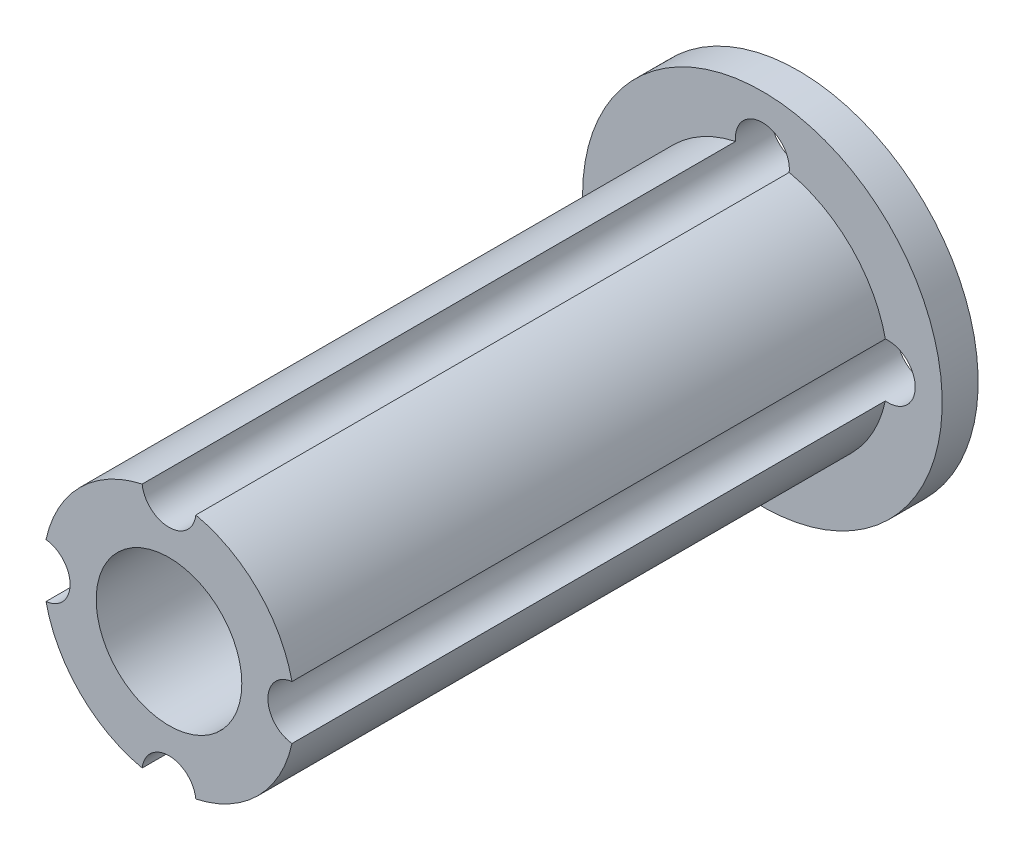
ISO-10303-21;
HEADER;
FILE_DESCRIPTION(('STEP AP214'),'2;1');
FILE_NAME('part.step','',(''),(''),'','','');
FILE_SCHEMA(('AUTOMOTIVE_DESIGN { 1 0 10303 214 1 1 1 1 }'));
ENDSEC;
DATA;
#1=APPLICATION_CONTEXT('core data for automotive mechanical design processes');
#2=APPLICATION_PROTOCOL_DEFINITION('international standard','automotive_design',2000,#1);
#3=PRODUCT_CONTEXT('',#1,'mechanical');
#4=PRODUCT('Part','Part','',(#3));
#5=PRODUCT_RELATED_PRODUCT_CATEGORY('part','',(#4));
#6=PRODUCT_DEFINITION_FORMATION('','',#4);
#7=PRODUCT_DEFINITION_CONTEXT('part definition',#1,'design');
#8=PRODUCT_DEFINITION('design','',#6,#7);
#9=PRODUCT_DEFINITION_SHAPE('','',#8);
#10=(LENGTH_UNIT() NAMED_UNIT(*) SI_UNIT(.MILLI.,.METRE.));
#11=(NAMED_UNIT(*) PLANE_ANGLE_UNIT() SI_UNIT($,.RADIAN.));
#12=(NAMED_UNIT(*) SI_UNIT($,.STERADIAN.) SOLID_ANGLE_UNIT());
#13=UNCERTAINTY_MEASURE_WITH_UNIT(LENGTH_MEASURE(1.E-05),#10,'distance_accuracy_value','');
#14=(GEOMETRIC_REPRESENTATION_CONTEXT(3) GLOBAL_UNCERTAINTY_ASSIGNED_CONTEXT((#13)) GLOBAL_UNIT_ASSIGNED_CONTEXT((#10,
#11,#12)) REPRESENTATION_CONTEXT('',''));
#15=CARTESIAN_POINT('',(0.,0.,0.));
#16=DIRECTION('',(0.,0.,1.));
#17=DIRECTION('',(1.,0.,0.));
#18=AXIS2_PLACEMENT_3D('',#15,#16,#17);
#19=CARTESIAN_POINT('',(0.,0.,35.));
#20=DIRECTION('',(0.,0.,-1.));
#21=DIRECTION('',(-1.,0.,0.));
#22=AXIS2_PLACEMENT_3D('',#19,#20,#21);
#23=CYLINDRICAL_SURFACE('',#22,7.);
#24=DIRECTION('',(0.,0.,-1.));
#25=VECTOR('',#24,1.);
#26=CARTESIAN_POINT('',(-6.83928571428571,1.49136545432947,20.5));
#27=LINE('',#26,#25);
#28=CARTESIAN_POINT('',(-6.83928571428571,1.49136545432947,35.));
#29=VERTEX_POINT('',#28);
#30=CARTESIAN_POINT('',(-6.83928571428571,1.49136545432947,2.));
#31=VERTEX_POINT('',#30);
#32=EDGE_CURVE('E140',#29,#31,#27,.T.);
#33=ORIENTED_EDGE('',*,*,#32,.F.);
#34=CARTESIAN_POINT('',(0.,0.,35.));
#35=DIRECTION('',(0.,0.,1.));
#36=DIRECTION('',(1.,0.,0.));
#37=AXIS2_PLACEMENT_3D('',#34,#35,#36);
#38=CIRCLE('',#37,7.);
#39=CARTESIAN_POINT('',(-1.49136545432947,6.83928571428571,35.));
#40=VERTEX_POINT('',#39);
#41=EDGE_CURVE('E123',#40,#29,#38,.T.);
#42=ORIENTED_EDGE('',*,*,#41,.F.);
#43=DIRECTION('',(0.,0.,-1.));
#44=VECTOR('',#43,1.);
#45=CARTESIAN_POINT('',(-1.49136545432947,6.83928571428571,20.5));
#46=LINE('',#45,#44);
#47=CARTESIAN_POINT('',(-1.49136545432947,6.83928571428571,2.));
#48=VERTEX_POINT('',#47);
#49=EDGE_CURVE('E108',#48,#40,#46,.F.);
#50=ORIENTED_EDGE('',*,*,#49,.F.);
#51=CARTESIAN_POINT('',(0.,0.,2.));
#52=DIRECTION('',(0.,0.,-1.));
#53=DIRECTION('',(-1.,0.,0.));
#54=AXIS2_PLACEMENT_3D('',#51,#52,#53);
#55=CIRCLE('',#54,7.);
#56=EDGE_CURVE('E11',#31,#48,#55,.T.);
#57=ORIENTED_EDGE('',*,*,#56,.F.);
#58=EDGE_LOOP('',(#33,#42,#50,#57));
#59=FACE_BOUND('',#58,.T.);
#60=ADVANCED_FACE('F39',(#59),#23,.T.);
#61=DIRECTION('',(0.,0.,-1.));
#62=VECTOR('',#61,1.);
#63=CARTESIAN_POINT('',(-6.83928571428571,-1.49136545432947,20.5));
#64=LINE('',#63,#62);
#65=CARTESIAN_POINT('',(-6.83928571428571,-1.49136545432947,2.));
#66=VERTEX_POINT('',#65);
#67=CARTESIAN_POINT('',(-6.83928571428571,-1.49136545432947,35.));
#68=VERTEX_POINT('',#67);
#69=EDGE_CURVE('E135',#66,#68,#64,.F.);
#70=ORIENTED_EDGE('',*,*,#69,.F.);
#71=CARTESIAN_POINT('',(-1.49136545432947,-6.83928571428571,2.));
#72=VERTEX_POINT('',#71);
#73=EDGE_CURVE('E48',#72,#66,#55,.T.);
#74=ORIENTED_EDGE('',*,*,#73,.F.);
#75=DIRECTION('',(0.,0.,-1.));
#76=VECTOR('',#75,1.);
#77=CARTESIAN_POINT('',(-1.49136545432947,-6.83928571428571,20.5));
#78=LINE('',#77,#76);
#79=CARTESIAN_POINT('',(-1.49136545432947,-6.83928571428572,35.));
#80=VERTEX_POINT('',#79);
#81=EDGE_CURVE('E55',#80,#72,#78,.T.);
#82=ORIENTED_EDGE('',*,*,#81,.F.);
#83=EDGE_CURVE('E170',#68,#80,#38,.T.);
#84=ORIENTED_EDGE('',*,*,#83,.F.);
#85=EDGE_LOOP('',(#70,#74,#82,#84));
#86=FACE_BOUND('',#85,.T.);
#87=ADVANCED_FACE('F180',(#86),#23,.T.);
#88=DIRECTION('',(0.,0.,-1.));
#89=VECTOR('',#88,1.);
#90=CARTESIAN_POINT('',(1.49136545432947,-6.83928571428571,20.5));
#91=LINE('',#90,#89);
#92=CARTESIAN_POINT('',(1.49136545432947,-6.83928571428571,2.));
#93=VERTEX_POINT('',#92);
#94=CARTESIAN_POINT('',(1.49136545432947,-6.83928571428571,35.));
#95=VERTEX_POINT('',#94);
#96=EDGE_CURVE('E182',#93,#95,#91,.F.);
#97=ORIENTED_EDGE('',*,*,#96,.F.);
#98=CARTESIAN_POINT('',(6.83928571428571,-1.49136545432947,2.));
#99=VERTEX_POINT('',#98);
#100=EDGE_CURVE('E169',#99,#93,#55,.T.);
#101=ORIENTED_EDGE('',*,*,#100,.F.);
#102=DIRECTION('',(0.,0.,-1.));
#103=VECTOR('',#102,1.);
#104=CARTESIAN_POINT('',(6.83928571428571,-1.49136545432947,20.5));
#105=LINE('',#104,#103);
#106=CARTESIAN_POINT('',(6.83928571428571,-1.49136545432947,35.));
#107=VERTEX_POINT('',#106);
#108=EDGE_CURVE('E63',#107,#99,#105,.T.);
#109=ORIENTED_EDGE('',*,*,#108,.F.);
#110=EDGE_CURVE('E158',#95,#107,#38,.T.);
#111=ORIENTED_EDGE('',*,*,#110,.F.);
#112=EDGE_LOOP('',(#97,#101,#109,#111));
#113=FACE_BOUND('',#112,.T.);
#114=ADVANCED_FACE('F246',(#113),#23,.T.);
#115=DIRECTION('',(0.,0.,-1.));
#116=VECTOR('',#115,1.);
#117=CARTESIAN_POINT('',(6.83928571428571,1.49136545432947,20.5));
#118=LINE('',#117,#116);
#119=CARTESIAN_POINT('',(6.83928571428571,1.49136545432947,2.));
#120=VERTEX_POINT('',#119);
#121=CARTESIAN_POINT('',(6.83928571428571,1.49136545432947,35.));
#122=VERTEX_POINT('',#121);
#123=EDGE_CURVE('E196',#120,#122,#118,.F.);
#124=ORIENTED_EDGE('',*,*,#123,.F.);
#125=CARTESIAN_POINT('',(1.49136545432947,6.83928571428571,2.));
#126=VERTEX_POINT('',#125);
#127=EDGE_CURVE('E47',#126,#120,#55,.T.);
#128=ORIENTED_EDGE('',*,*,#127,.F.);
#129=DIRECTION('',(0.,0.,-1.));
#130=VECTOR('',#129,1.);
#131=CARTESIAN_POINT('',(1.49136545432947,6.83928571428571,20.5));
#132=LINE('',#131,#130);
#133=CARTESIAN_POINT('',(1.49136545432947,6.83928571428571,35.));
#134=VERTEX_POINT('',#133);
#135=EDGE_CURVE('E111',#134,#126,#132,.T.);
#136=ORIENTED_EDGE('',*,*,#135,.F.);
#137=EDGE_CURVE('E161',#122,#134,#38,.T.);
#138=ORIENTED_EDGE('',*,*,#137,.F.);
#139=EDGE_LOOP('',(#124,#128,#136,#138));
#140=FACE_BOUND('',#139,.T.);
#141=ADVANCED_FACE('F242',(#140),#23,.T.);
#142=CARTESIAN_POINT('',(0.,0.,35.));
#143=DIRECTION('',(0.,0.,1.));
#144=DIRECTION('',(1.,0.,0.));
#145=AXIS2_PLACEMENT_3D('',#142,#143,#144);
#146=PLANE('',#145);
#147=CARTESIAN_POINT('',(0.,0.,35.));
#148=DIRECTION('',(0.,0.,1.));
#149=DIRECTION('',(1.,0.,0.));
#150=AXIS2_PLACEMENT_3D('',#147,#148,#149);
#151=CIRCLE('',#150,4.05);
#152=CARTESIAN_POINT('',(4.05,0.,35.));
#153=VERTEX_POINT('',#152);
#154=EDGE_CURVE('E136',#153,#153,#151,.F.);
#155=ORIENTED_EDGE('',*,*,#154,.T.);
#156=EDGE_LOOP('',(#155));
#157=FACE_BOUND('',#156,.T.);
#158=ORIENTED_EDGE('',*,*,#41,.T.);
#159=CARTESIAN_POINT('',(-7.,0.,35.));
#160=DIRECTION('',(0.,0.,1.));
#161=DIRECTION('',(1.,0.,0.));
#162=AXIS2_PLACEMENT_3D('',#159,#160,#161);
#163=CIRCLE('',#162,1.5);
#164=EDGE_CURVE('E149',#29,#68,#163,.F.);
#165=ORIENTED_EDGE('',*,*,#164,.T.);
#166=ORIENTED_EDGE('',*,*,#83,.T.);
#167=CARTESIAN_POINT('',(0.,-7.,35.));
#168=DIRECTION('',(0.,0.,1.));
#169=DIRECTION('',(1.,0.,0.));
#170=AXIS2_PLACEMENT_3D('',#167,#168,#169);
#171=CIRCLE('',#170,1.5);
#172=EDGE_CURVE('E143',#80,#95,#171,.F.);
#173=ORIENTED_EDGE('',*,*,#172,.T.);
#174=ORIENTED_EDGE('',*,*,#110,.T.);
#175=CARTESIAN_POINT('',(7.,0.,35.));
#176=DIRECTION('',(0.,0.,1.));
#177=DIRECTION('',(1.,0.,0.));
#178=AXIS2_PLACEMENT_3D('',#175,#176,#177);
#179=CIRCLE('',#178,1.5);
#180=EDGE_CURVE('E191',#107,#122,#179,.F.);
#181=ORIENTED_EDGE('',*,*,#180,.T.);
#182=ORIENTED_EDGE('',*,*,#137,.T.);
#183=CARTESIAN_POINT('',(0.,7.,35.));
#184=DIRECTION('',(0.,0.,1.));
#185=DIRECTION('',(1.,0.,0.));
#186=AXIS2_PLACEMENT_3D('',#183,#184,#185);
#187=CIRCLE('',#186,1.5);
#188=EDGE_CURVE('E202',#134,#40,#187,.F.);
#189=ORIENTED_EDGE('',*,*,#188,.T.);
#190=EDGE_LOOP('',(#158,#165,#166,#173,#174,#181,#182,#189));
#191=FACE_BOUND('',#190,.T.);
#192=ADVANCED_FACE('F178',(#157,#191),#146,.T.);
#193=CARTESIAN_POINT('',(0.,0.,2.));
#194=DIRECTION('',(0.,0.,-1.));
#195=DIRECTION('',(-1.,0.,0.));
#196=AXIS2_PLACEMENT_3D('',#193,#194,#195);
#197=CYLINDRICAL_SURFACE('',#196,10.);
#198=CARTESIAN_POINT('',(0.,0.,2.));
#199=DIRECTION('',(0.,0.,-1.));
#200=DIRECTION('',(-1.,0.,0.));
#201=AXIS2_PLACEMENT_3D('',#198,#199,#200);
#202=CIRCLE('',#201,10.);
#203=CARTESIAN_POINT('',(-10.,0.,2.));
#204=VERTEX_POINT('',#203);
#205=EDGE_CURVE('E154',#204,#204,#202,.T.);
#206=ORIENTED_EDGE('',*,*,#205,.T.);
#207=EDGE_LOOP('',(#206));
#208=FACE_BOUND('',#207,.T.);
#209=CARTESIAN_POINT('',(0.,0.,0.));
#210=DIRECTION('',(0.,0.,-1.));
#211=DIRECTION('',(-1.,0.,0.));
#212=AXIS2_PLACEMENT_3D('',#209,#210,#211);
#213=CIRCLE('',#212,10.);
#214=CARTESIAN_POINT('',(-10.,0.,0.));
#215=VERTEX_POINT('',#214);
#216=EDGE_CURVE('E153',#215,#215,#213,.T.);
#217=ORIENTED_EDGE('',*,*,#216,.F.);
#218=EDGE_LOOP('',(#217));
#219=FACE_BOUND('',#218,.T.);
#220=ADVANCED_FACE('F253',(#208,#219),#197,.T.);
#221=CARTESIAN_POINT('',(0.,0.,2.));
#222=DIRECTION('',(0.,0.,-1.));
#223=DIRECTION('',(-1.,0.,0.));
#224=AXIS2_PLACEMENT_3D('',#221,#222,#223);
#225=PLANE('',#224);
#226=CARTESIAN_POINT('',(-7.,0.,2.));
#227=DIRECTION('',(0.,0.,-1.));
#228=DIRECTION('',(-1.,0.,0.));
#229=AXIS2_PLACEMENT_3D('',#226,#227,#228);
#230=CIRCLE('',#229,1.5);
#231=EDGE_CURVE('E130',#31,#66,#230,.F.);
#232=ORIENTED_EDGE('',*,*,#231,.F.);
#233=ORIENTED_EDGE('',*,*,#56,.T.);
#234=CARTESIAN_POINT('',(0.,7.,2.));
#235=DIRECTION('',(0.,0.,-1.));
#236=DIRECTION('',(-1.,0.,0.));
#237=AXIS2_PLACEMENT_3D('',#234,#235,#236);
#238=CIRCLE('',#237,1.5);
#239=EDGE_CURVE('E104',#126,#48,#238,.F.);
#240=ORIENTED_EDGE('',*,*,#239,.F.);
#241=ORIENTED_EDGE('',*,*,#127,.T.);
#242=CARTESIAN_POINT('',(7.,0.,2.));
#243=DIRECTION('',(0.,0.,-1.));
#244=DIRECTION('',(-1.,0.,0.));
#245=AXIS2_PLACEMENT_3D('',#242,#243,#244);
#246=CIRCLE('',#245,1.5);
#247=EDGE_CURVE('E199',#99,#120,#246,.F.);
#248=ORIENTED_EDGE('',*,*,#247,.F.);
#249=ORIENTED_EDGE('',*,*,#100,.T.);
#250=CARTESIAN_POINT('',(0.,-7.,2.));
#251=DIRECTION('',(0.,0.,-1.));
#252=DIRECTION('',(-1.,0.,0.));
#253=AXIS2_PLACEMENT_3D('',#250,#251,#252);
#254=CIRCLE('',#253,1.5);
#255=EDGE_CURVE('E186',#72,#93,#254,.F.);
#256=ORIENTED_EDGE('',*,*,#255,.F.);
#257=ORIENTED_EDGE('',*,*,#73,.T.);
#258=EDGE_LOOP('',(#232,#233,#240,#241,#248,#249,#256,#257));
#259=FACE_BOUND('',#258,.T.);
#260=ORIENTED_EDGE('',*,*,#205,.F.);
#261=EDGE_LOOP('',(#260));
#262=FACE_BOUND('',#261,.T.);
#263=ADVANCED_FACE('F127',(#259,#262),#225,.F.);
#264=CARTESIAN_POINT('',(0.,0.,0.));
#265=DIRECTION('',(0.,0.,1.));
#266=DIRECTION('',(1.,0.,0.));
#267=AXIS2_PLACEMENT_3D('',#264,#265,#266);
#268=PLANE('',#267);
#269=CARTESIAN_POINT('',(-7.,0.,0.));
#270=DIRECTION('',(0.,0.,1.));
#271=DIRECTION('',(1.,0.,0.));
#272=AXIS2_PLACEMENT_3D('',#269,#270,#271);
#273=CIRCLE('',#272,1.5);
#274=CARTESIAN_POINT('',(-5.5,0.,0.));
#275=VERTEX_POINT('',#274);
#276=EDGE_CURVE('E116',#275,#275,#273,.T.);
#277=ORIENTED_EDGE('',*,*,#276,.T.);
#278=EDGE_LOOP('',(#277));
#279=FACE_BOUND('',#278,.T.);
#280=CARTESIAN_POINT('',(0.,0.,0.));
#281=DIRECTION('',(0.,0.,1.));
#282=DIRECTION('',(1.,0.,0.));
#283=AXIS2_PLACEMENT_3D('',#280,#281,#282);
#284=CIRCLE('',#283,4.05);
#285=CARTESIAN_POINT('',(4.05,0.,0.));
#286=VERTEX_POINT('',#285);
#287=EDGE_CURVE('E216',#286,#286,#284,.T.);
#288=ORIENTED_EDGE('',*,*,#287,.T.);
#289=EDGE_LOOP('',(#288));
#290=FACE_BOUND('',#289,.T.);
#291=CARTESIAN_POINT('',(0.,-7.,0.));
#292=DIRECTION('',(0.,0.,1.));
#293=DIRECTION('',(1.,0.,0.));
#294=AXIS2_PLACEMENT_3D('',#291,#292,#293);
#295=CIRCLE('',#294,1.5);
#296=CARTESIAN_POINT('',(1.5,-7.,0.));
#297=VERTEX_POINT('',#296);
#298=EDGE_CURVE('E212',#297,#297,#295,.T.);
#299=ORIENTED_EDGE('',*,*,#298,.T.);
#300=EDGE_LOOP('',(#299));
#301=FACE_BOUND('',#300,.T.);
#302=CARTESIAN_POINT('',(7.,0.,0.));
#303=DIRECTION('',(0.,0.,1.));
#304=DIRECTION('',(1.,0.,0.));
#305=AXIS2_PLACEMENT_3D('',#302,#303,#304);
#306=CIRCLE('',#305,1.5);
#307=CARTESIAN_POINT('',(8.5,0.,0.));
#308=VERTEX_POINT('',#307);
#309=EDGE_CURVE('E207',#308,#308,#306,.T.);
#310=ORIENTED_EDGE('',*,*,#309,.T.);
#311=EDGE_LOOP('',(#310));
#312=FACE_BOUND('',#311,.T.);
#313=CARTESIAN_POINT('',(0.,7.,0.));
#314=DIRECTION('',(0.,0.,1.));
#315=DIRECTION('',(1.,0.,0.));
#316=AXIS2_PLACEMENT_3D('',#313,#314,#315);
#317=CIRCLE('',#316,1.5);
#318=CARTESIAN_POINT('',(1.5,7.,0.));
#319=VERTEX_POINT('',#318);
#320=EDGE_CURVE('E211',#319,#319,#317,.T.);
#321=ORIENTED_EDGE('',*,*,#320,.T.);
#322=EDGE_LOOP('',(#321));
#323=FACE_BOUND('',#322,.T.);
#324=ORIENTED_EDGE('',*,*,#216,.T.);
#325=EDGE_LOOP('',(#324));
#326=FACE_BOUND('',#325,.T.);
#327=ADVANCED_FACE('F227',(#279,#290,#301,#312,#323,#326),#268,.F.);
#328=CARTESIAN_POINT('',(0.,7.,41.));
#329=DIRECTION('',(0.,0.,-1.));
#330=DIRECTION('',(-1.,0.,0.));
#331=AXIS2_PLACEMENT_3D('',#328,#329,#330);
#332=CYLINDRICAL_SURFACE('',#331,1.5);
#333=ORIENTED_EDGE('',*,*,#135,.T.);
#334=ORIENTED_EDGE('',*,*,#239,.T.);
#335=ORIENTED_EDGE('',*,*,#49,.T.);
#336=ORIENTED_EDGE('',*,*,#188,.F.);
#337=EDGE_LOOP('',(#333,#334,#335,#336));
#338=FACE_BOUND('',#337,.T.);
#339=ORIENTED_EDGE('',*,*,#320,.F.);
#340=EDGE_LOOP('',(#339));
#341=FACE_BOUND('',#340,.T.);
#342=ADVANCED_FACE('F106',(#338,#341),#332,.F.);
#343=CARTESIAN_POINT('',(7.,0.,41.));
#344=DIRECTION('',(0.,0.,-1.));
#345=DIRECTION('',(-1.,0.,0.));
#346=AXIS2_PLACEMENT_3D('',#343,#344,#345);
#347=CYLINDRICAL_SURFACE('',#346,1.5);
#348=ORIENTED_EDGE('',*,*,#108,.T.);
#349=ORIENTED_EDGE('',*,*,#247,.T.);
#350=ORIENTED_EDGE('',*,*,#123,.T.);
#351=ORIENTED_EDGE('',*,*,#180,.F.);
#352=EDGE_LOOP('',(#348,#349,#350,#351));
#353=FACE_BOUND('',#352,.T.);
#354=ORIENTED_EDGE('',*,*,#309,.F.);
#355=EDGE_LOOP('',(#354));
#356=FACE_BOUND('',#355,.T.);
#357=ADVANCED_FACE('F265',(#353,#356),#347,.F.);
#358=CARTESIAN_POINT('',(0.,-7.,41.));
#359=DIRECTION('',(0.,0.,-1.));
#360=DIRECTION('',(-1.,0.,0.));
#361=AXIS2_PLACEMENT_3D('',#358,#359,#360);
#362=CYLINDRICAL_SURFACE('',#361,1.5);
#363=ORIENTED_EDGE('',*,*,#81,.T.);
#364=ORIENTED_EDGE('',*,*,#255,.T.);
#365=ORIENTED_EDGE('',*,*,#96,.T.);
#366=ORIENTED_EDGE('',*,*,#172,.F.);
#367=EDGE_LOOP('',(#363,#364,#365,#366));
#368=FACE_BOUND('',#367,.T.);
#369=ORIENTED_EDGE('',*,*,#298,.F.);
#370=EDGE_LOOP('',(#369));
#371=FACE_BOUND('',#370,.T.);
#372=ADVANCED_FACE('F237',(#368,#371),#362,.F.);
#373=CARTESIAN_POINT('',(0.,0.,41.));
#374=DIRECTION('',(0.,0.,-1.));
#375=DIRECTION('',(-1.,0.,0.));
#376=AXIS2_PLACEMENT_3D('',#373,#374,#375);
#377=CYLINDRICAL_SURFACE('',#376,4.05);
#378=ORIENTED_EDGE('',*,*,#154,.F.);
#379=EDGE_LOOP('',(#378));
#380=FACE_BOUND('',#379,.T.);
#381=ORIENTED_EDGE('',*,*,#287,.F.);
#382=EDGE_LOOP('',(#381));
#383=FACE_BOUND('',#382,.T.);
#384=ADVANCED_FACE('F232',(#380,#383),#377,.F.);
#385=CARTESIAN_POINT('',(-7.,0.,41.));
#386=DIRECTION('',(0.,0.,-1.));
#387=DIRECTION('',(-1.,0.,0.));
#388=AXIS2_PLACEMENT_3D('',#385,#386,#387);
#389=CYLINDRICAL_SURFACE('',#388,1.5);
#390=ORIENTED_EDGE('',*,*,#32,.T.);
#391=ORIENTED_EDGE('',*,*,#231,.T.);
#392=ORIENTED_EDGE('',*,*,#69,.T.);
#393=ORIENTED_EDGE('',*,*,#164,.F.);
#394=EDGE_LOOP('',(#390,#391,#392,#393));
#395=FACE_BOUND('',#394,.T.);
#396=ORIENTED_EDGE('',*,*,#276,.F.);
#397=EDGE_LOOP('',(#396));
#398=FACE_BOUND('',#397,.T.);
#399=ADVANCED_FACE('F230',(#395,#398),#389,.F.);
#400=CLOSED_SHELL('',(#60,#87,#114,#141,#192,#220,#263,#327,#342,#357,#372,#384,#399));
#401=MANIFOLD_SOLID_BREP('B2',#400);
#402=ADVANCED_BREP_SHAPE_REPRESENTATION('',(#18,#401),#14);
#403=SHAPE_DEFINITION_REPRESENTATION(#9,#402);
ENDSEC;
END-ISO-10303-21;
